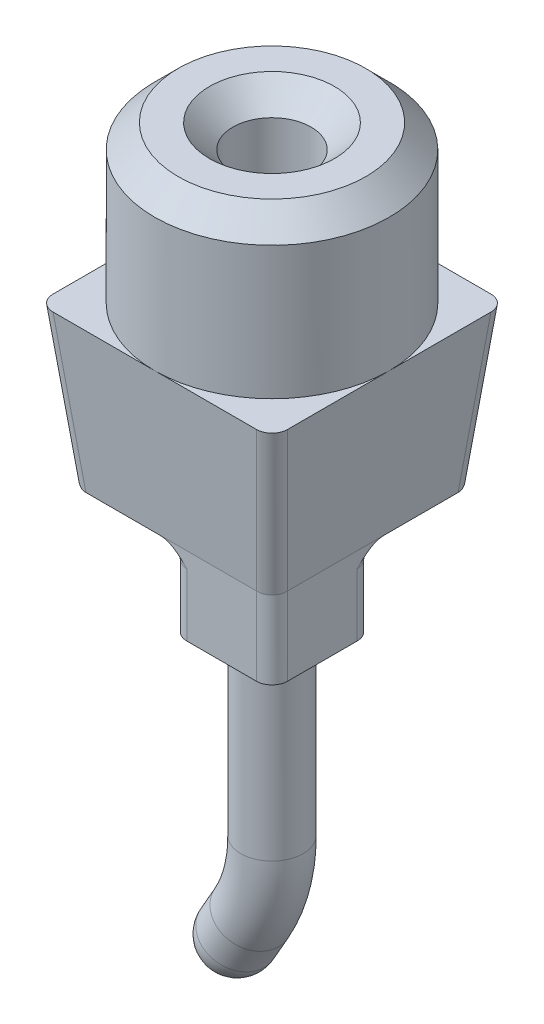
ISO-10303-21;
HEADER;
FILE_DESCRIPTION(('STEP AP214'),'2;1');
FILE_NAME('part.step','',(''),(''),'','','');
FILE_SCHEMA(('AUTOMOTIVE_DESIGN { 1 0 10303 214 1 1 1 1 }'));
ENDSEC;
DATA;
#1=APPLICATION_CONTEXT('core data for automotive mechanical design processes');
#2=APPLICATION_PROTOCOL_DEFINITION('international standard','automotive_design',2000,#1);
#3=PRODUCT_CONTEXT('',#1,'mechanical');
#4=PRODUCT('Part','Part','',(#3));
#5=PRODUCT_RELATED_PRODUCT_CATEGORY('part','',(#4));
#6=PRODUCT_DEFINITION_FORMATION('','',#4);
#7=PRODUCT_DEFINITION_CONTEXT('part definition',#1,'design');
#8=PRODUCT_DEFINITION('design','',#6,#7);
#9=PRODUCT_DEFINITION_SHAPE('','',#8);
#10=(LENGTH_UNIT() NAMED_UNIT(*) SI_UNIT(.MILLI.,.METRE.));
#11=(NAMED_UNIT(*) PLANE_ANGLE_UNIT() SI_UNIT($,.RADIAN.));
#12=(NAMED_UNIT(*) SI_UNIT($,.STERADIAN.) SOLID_ANGLE_UNIT());
#13=UNCERTAINTY_MEASURE_WITH_UNIT(LENGTH_MEASURE(1.E-05),#10,'distance_accuracy_value','');
#14=(GEOMETRIC_REPRESENTATION_CONTEXT(3) GLOBAL_UNCERTAINTY_ASSIGNED_CONTEXT((#13)) GLOBAL_UNIT_ASSIGNED_CONTEXT((#10,
#11,#12)) REPRESENTATION_CONTEXT('',''));
#15=CARTESIAN_POINT('',(0.,0.,0.));
#16=DIRECTION('',(0.,0.,1.));
#17=DIRECTION('',(1.,0.,0.));
#18=AXIS2_PLACEMENT_3D('',#15,#16,#17);
#19=CARTESIAN_POINT('',(0.,-40.,0.));
#20=DIRECTION('',(0.,-1.,0.));
#21=DIRECTION('',(0.,0.,-1.));
#22=AXIS2_PLACEMENT_3D('',#19,#20,#21);
#23=PLANE('',#22);
#24=DIRECTION('',(0.,0.,1.));
#25=VECTOR('',#24,1.);
#26=CARTESIAN_POINT('',(-11.0971072060908,-40.,0.));
#27=LINE('',#26,#25);
#28=CARTESIAN_POINT('',(-11.0971072060908,-40.,12.8890761298714));
#29=VERTEX_POINT('',#28);
#30=CARTESIAN_POINT('',(-11.0971072060908,-40.,-11.0971072060908));
#31=VERTEX_POINT('',#30);
#32=EDGE_CURVE('E186',#29,#31,#27,.F.);
#33=ORIENTED_EDGE('',*,*,#32,.T.);
#34=DIRECTION('',(-1.,0.,0.));
#35=VECTOR('',#34,1.);
#36=CARTESIAN_POINT('',(10.9088715039499,-40.,-11.0971072060908));
#37=LINE('',#36,#35);
#38=CARTESIAN_POINT('',(12.8890761298714,-40.,-11.0971072060908));
#39=VERTEX_POINT('',#38);
#40=EDGE_CURVE('E194',#31,#39,#37,.F.);
#41=ORIENTED_EDGE('',*,*,#40,.T.);
#42=CARTESIAN_POINT('',(10.8868987355594,-40.,-10.8868987355594));
#43=DIRECTION('',(0.,-1.,0.));
#44=DIRECTION('',(0.707106781186548,0.,-0.707106781186548));
#45=AXIS2_PLACEMENT_3D('',#42,#43,#44);
#46=ELLIPSE('',#45,2.0219730963013,2.);
#47=CARTESIAN_POINT('',(12.8979152946865,-40.,-10.9088715039499));
#48=VERTEX_POINT('',#47);
#49=EDGE_CURVE('E453',#39,#48,#46,.T.);
#50=ORIENTED_EDGE('',*,*,#49,.T.);
#51=DIRECTION('',(0.,0.,-1.));
#52=VECTOR('',#51,1.);
#53=CARTESIAN_POINT('',(12.8979152946865,-40.,0.));
#54=LINE('',#53,#52);
#55=CARTESIAN_POINT('',(12.8979152946865,-40.,-1.46410161513775));
#56=VERTEX_POINT('',#55);
#57=EDGE_CURVE('E528',#48,#56,#54,.F.);
#58=ORIENTED_EDGE('',*,*,#57,.T.);
#59=CARTESIAN_POINT('',(10.8979152946865,-40.,2.));
#60=DIRECTION('',(0.,-1.,0.));
#61=DIRECTION('',(0.,0.,-1.));
#62=AXIS2_PLACEMENT_3D('',#59,#60,#61);
#63=CIRCLE('',#62,4.);
#64=CARTESIAN_POINT('',(10.8979152946865,-40.,-2.));
#65=VERTEX_POINT('',#64);
#66=EDGE_CURVE('E176',#56,#65,#63,.F.);
#67=ORIENTED_EDGE('',*,*,#66,.T.);
#68=DIRECTION('',(1.,0.,0.));
#69=VECTOR('',#68,1.);
#70=CARTESIAN_POINT('',(0.,-40.,-2.));
#71=LINE('',#70,#69);
#72=CARTESIAN_POINT('',(2.,-40.,-2.));
#73=VERTEX_POINT('',#72);
#74=EDGE_CURVE('E181',#65,#73,#71,.F.);
#75=ORIENTED_EDGE('',*,*,#74,.T.);
#76=CARTESIAN_POINT('',(2.,-40.,2.));
#77=DIRECTION('',(0.,-1.,0.));
#78=DIRECTION('',(0.,0.,-1.));
#79=AXIS2_PLACEMENT_3D('',#76,#77,#78);
#80=CIRCLE('',#79,4.);
#81=CARTESIAN_POINT('',(-2.,-40.,2.));
#82=VERTEX_POINT('',#81);
#83=EDGE_CURVE('E188',#73,#82,#80,.F.);
#84=ORIENTED_EDGE('',*,*,#83,.T.);
#85=DIRECTION('',(0.,0.,1.));
#86=VECTOR('',#85,1.);
#87=CARTESIAN_POINT('',(-2.,-40.,10.8979152946865));
#88=LINE('',#87,#86);
#89=CARTESIAN_POINT('',(-2.,-40.,10.8979152946865));
#90=VERTEX_POINT('',#89);
#91=EDGE_CURVE('E392',#82,#90,#88,.T.);
#92=ORIENTED_EDGE('',*,*,#91,.T.);
#93=CARTESIAN_POINT('',(2.,-40.,10.8979152946865));
#94=DIRECTION('',(0.,-1.,0.));
#95=DIRECTION('',(0.,0.,-1.));
#96=AXIS2_PLACEMENT_3D('',#93,#94,#95);
#97=CIRCLE('',#96,4.);
#98=CARTESIAN_POINT('',(-1.46410161513775,-40.,12.8979152946865));
#99=VERTEX_POINT('',#98);
#100=EDGE_CURVE('E180',#90,#99,#97,.F.);
#101=ORIENTED_EDGE('',*,*,#100,.T.);
#102=DIRECTION('',(1.,0.,0.));
#103=VECTOR('',#102,1.);
#104=CARTESIAN_POINT('',(0.,-40.,12.8979152946865));
#105=LINE('',#104,#103);
#106=CARTESIAN_POINT('',(-10.9088715039499,-40.,12.8979152946865));
#107=VERTEX_POINT('',#106);
#108=EDGE_CURVE('E531',#107,#99,#105,.T.);
#109=ORIENTED_EDGE('',*,*,#108,.F.);
#110=CARTESIAN_POINT('',(-10.8868987355594,-40.,10.8868987355594));
#111=DIRECTION('',(0.,-1.,0.));
#112=DIRECTION('',(-0.707106781186548,0.,0.707106781186548));
#113=AXIS2_PLACEMENT_3D('',#110,#111,#112);
#114=ELLIPSE('',#113,2.0219730963013,2.);
#115=EDGE_CURVE('E449',#107,#29,#114,.T.);
#116=ORIENTED_EDGE('',*,*,#115,.T.);
#117=EDGE_LOOP('',(#33,#41,#50,#58,#67,#75,#84,#92,#101,#109,#116));
#118=FACE_BOUND('',#117,.T.);
#119=ADVANCED_FACE('F51',(#118),#23,.T.);
#120=CARTESIAN_POINT('',(0.,-20.,0.));
#121=DIRECTION('',(0.,1.,0.));
#122=DIRECTION('',(0.,0.,1.));
#123=AXIS2_PLACEMENT_3D('',#120,#121,#122);
#124=CYLINDRICAL_SURFACE('',#123,5.);
#125=CARTESIAN_POINT('',(0.,-2.99999999999998,0.));
#126=DIRECTION('',(0.,1.,0.));
#127=DIRECTION('',(0.,0.,1.));
#128=AXIS2_PLACEMENT_3D('',#125,#126,#127);
#129=CIRCLE('',#128,5.);
#130=CARTESIAN_POINT('',(0.,-2.99999999999998,5.));
#131=VERTEX_POINT('',#130);
#132=EDGE_CURVE('E397',#131,#131,#129,.T.);
#133=ORIENTED_EDGE('',*,*,#132,.T.);
#134=EDGE_LOOP('',(#133));
#135=FACE_BOUND('',#134,.T.);
#136=CARTESIAN_POINT('',(0.,-20.,0.));
#137=DIRECTION('',(0.,1.,0.));
#138=DIRECTION('',(0.,0.,1.));
#139=AXIS2_PLACEMENT_3D('',#136,#137,#138);
#140=CIRCLE('',#139,5.);
#141=CARTESIAN_POINT('',(0.,-20.,5.));
#142=VERTEX_POINT('',#141);
#143=EDGE_CURVE('E524',#142,#142,#140,.T.);
#144=ORIENTED_EDGE('',*,*,#143,.F.);
#145=EDGE_LOOP('',(#144));
#146=FACE_BOUND('',#145,.T.);
#147=ADVANCED_FACE('F259',(#135,#146),#124,.F.);
#148=CARTESIAN_POINT('',(0.,-20.,0.));
#149=DIRECTION('',(0.,1.,0.));
#150=DIRECTION('',(0.,0.,1.));
#151=AXIS2_PLACEMENT_3D('',#148,#149,#150);
#152=CYLINDRICAL_SURFACE('',#151,15.);
#153=CARTESIAN_POINT('',(0.,-3.,0.));
#154=DIRECTION('',(0.,1.,0.));
#155=DIRECTION('',(0.,0.,1.));
#156=AXIS2_PLACEMENT_3D('',#153,#154,#155);
#157=CIRCLE('',#156,15.);
#158=CARTESIAN_POINT('',(0.,-3.,15.));
#159=VERTEX_POINT('',#158);
#160=EDGE_CURVE('E401',#159,#159,#157,.F.);
#161=ORIENTED_EDGE('',*,*,#160,.T.);
#162=EDGE_LOOP('',(#161));
#163=FACE_BOUND('',#162,.T.);
#164=CARTESIAN_POINT('',(0.,-20.,0.));
#165=DIRECTION('',(0.,1.,0.));
#166=DIRECTION('',(0.,0.,1.));
#167=AXIS2_PLACEMENT_3D('',#164,#165,#166);
#168=CIRCLE('',#167,15.);
#169=CARTESIAN_POINT('',(0.,-20.,15.));
#170=VERTEX_POINT('',#169);
#171=CARTESIAN_POINT('',(15.,-20.,0.));
#172=VERTEX_POINT('',#171);
#173=EDGE_CURVE('E518',#170,#172,#168,.T.);
#174=ORIENTED_EDGE('',*,*,#173,.T.);
#175=CARTESIAN_POINT('',(0.,-20.,-15.));
#176=VERTEX_POINT('',#175);
#177=EDGE_CURVE('E522',#172,#176,#168,.T.);
#178=ORIENTED_EDGE('',*,*,#177,.T.);
#179=CARTESIAN_POINT('',(-15.,-20.,0.));
#180=VERTEX_POINT('',#179);
#181=EDGE_CURVE('E674',#176,#180,#168,.T.);
#182=ORIENTED_EDGE('',*,*,#181,.T.);
#183=EDGE_CURVE('E523',#180,#170,#168,.T.);
#184=ORIENTED_EDGE('',*,*,#183,.T.);
#185=EDGE_LOOP('',(#174,#178,#182,#184));
#186=FACE_BOUND('',#185,.T.);
#187=ADVANCED_FACE('F264',(#163,#186),#152,.T.);
#188=CARTESIAN_POINT('',(0.,0.,0.));
#189=DIRECTION('',(0.,1.,0.));
#190=DIRECTION('',(0.,0.,1.));
#191=AXIS2_PLACEMENT_3D('',#188,#189,#190);
#192=PLANE('',#191);
#193=CARTESIAN_POINT('',(0.,0.,0.));
#194=DIRECTION('',(0.,1.,0.));
#195=DIRECTION('',(0.,0.,1.));
#196=AXIS2_PLACEMENT_3D('',#193,#194,#195);
#197=CIRCLE('',#196,12.);
#198=CARTESIAN_POINT('',(0.,0.,12.));
#199=VERTEX_POINT('',#198);
#200=EDGE_CURVE('E407',#199,#199,#197,.T.);
#201=ORIENTED_EDGE('',*,*,#200,.T.);
#202=EDGE_LOOP('',(#201));
#203=FACE_BOUND('',#202,.T.);
#204=CARTESIAN_POINT('',(0.,0.,0.));
#205=DIRECTION('',(0.,1.,0.));
#206=DIRECTION('',(0.,0.,1.));
#207=AXIS2_PLACEMENT_3D('',#204,#205,#206);
#208=CIRCLE('',#207,8.00000000000001);
#209=CARTESIAN_POINT('',(0.,0.,8.00000000000001));
#210=VERTEX_POINT('',#209);
#211=EDGE_CURVE('E411',#210,#210,#208,.F.);
#212=ORIENTED_EDGE('',*,*,#211,.T.);
#213=EDGE_LOOP('',(#212));
#214=FACE_BOUND('',#213,.T.);
#215=ADVANCED_FACE('F275',(#203,#214),#192,.T.);
#216=CARTESIAN_POINT('',(0.,-20.,0.));
#217=DIRECTION('',(0.,-1.,0.));
#218=DIRECTION('',(0.,0.,-1.));
#219=AXIS2_PLACEMENT_3D('',#216,#217,#218);
#220=PLANE('',#219);
#221=DIRECTION('',(0.,0.,1.));
#222=VECTOR('',#221,1.);
#223=CARTESIAN_POINT('',(-15.,-20.,0.));
#224=LINE('',#223,#222);
#225=CARTESIAN_POINT('',(-15.,-20.,13.0109562092635));
#226=VERTEX_POINT('',#225);
#227=EDGE_CURVE('E549',#180,#226,#224,.T.);
#228=ORIENTED_EDGE('',*,*,#227,.T.);
#229=CARTESIAN_POINT('',(-12.988983440873,-20.,12.988983440873));
#230=DIRECTION('',(0.,-1.,0.));
#231=DIRECTION('',(-0.707106781186548,0.,0.707106781186548));
#232=AXIS2_PLACEMENT_3D('',#229,#230,#231);
#233=ELLIPSE('',#232,2.0219730963013,2.);
#234=CARTESIAN_POINT('',(-13.0109562092635,-20.,15.));
#235=VERTEX_POINT('',#234);
#236=EDGE_CURVE('E445',#226,#235,#233,.F.);
#237=ORIENTED_EDGE('',*,*,#236,.T.);
#238=DIRECTION('',(1.,0.,0.));
#239=VECTOR('',#238,1.);
#240=CARTESIAN_POINT('',(0.,-20.,15.));
#241=LINE('',#240,#239);
#242=EDGE_CURVE('E550',#235,#170,#241,.T.);
#243=ORIENTED_EDGE('',*,*,#242,.T.);
#244=ORIENTED_EDGE('',*,*,#183,.F.);
#245=EDGE_LOOP('',(#228,#237,#243,#244));
#246=FACE_BOUND('',#245,.T.);
#247=ADVANCED_FACE('F271',(#246),#220,.F.);
#248=CARTESIAN_POINT('',(15.,-20.,0.));
#249=DIRECTION('',(0.994521895368273,-0.104528463267653,0.));
#250=DIRECTION('',(0.104528463267653,0.994521895368273,0.));
#251=AXIS2_PLACEMENT_3D('',#248,#249,#250);
#252=PLANE('',#251);
#253=ORIENTED_EDGE('',*,*,#57,.F.);
#254=DIRECTION('',(-0.103962051184498,-0.989132844377854,0.103962051184498));
#255=VECTOR('',#254,1.);
#256=CARTESIAN_POINT('',(14.8593761789817,-21.3379462841133,-12.8703323882452));
#257=LINE('',#256,#255);
#258=CARTESIAN_POINT('',(15.,-20.,-13.0109562092635));
#259=VERTEX_POINT('',#258);
#260=EDGE_CURVE('E430',#48,#259,#257,.F.);
#261=ORIENTED_EDGE('',*,*,#260,.T.);
#262=DIRECTION('',(0.,0.,1.));
#263=VECTOR('',#262,1.);
#264=CARTESIAN_POINT('',(15.,-20.,0.));
#265=LINE('',#264,#263);
#266=EDGE_CURVE('E535',#259,#172,#265,.T.);
#267=ORIENTED_EDGE('',*,*,#266,.T.);
#268=CARTESIAN_POINT('',(15.,-20.,13.0109562092635));
#269=VERTEX_POINT('',#268);
#270=EDGE_CURVE('E539',#172,#269,#265,.T.);
#271=ORIENTED_EDGE('',*,*,#270,.T.);
#272=DIRECTION('',(0.103962051184498,0.989132844377854,0.103962051184498));
#273=VECTOR('',#272,1.);
#274=CARTESIAN_POINT('',(12.9194130949655,-39.7954620931811,10.930369304229));
#275=LINE('',#274,#273);
#276=CARTESIAN_POINT('',(12.8978854481134,-40.0002839711743,10.9088416573768));
#277=VERTEX_POINT('',#276);
#278=EDGE_CURVE('E434',#269,#277,#275,.F.);
#279=ORIENTED_EDGE('',*,*,#278,.T.);
#280=CARTESIAN_POINT('',(10.8979152946865,-59.0287289084452,10.8979152946865));
#281=DIRECTION('',(0.994521895368273,-0.104528463267653,0.));
#282=DIRECTION('',(0.104528463267653,0.994521895368273,0.));
#283=AXIS2_PLACEMENT_3D('',#280,#281,#282);
#284=ELLIPSE('',#283,19.1335444670112,2.);
#285=CARTESIAN_POINT('',(12.8979152946865,-40.,10.8979152946865));
#286=VERTEX_POINT('',#285);
#287=EDGE_CURVE('E414',#277,#286,#284,.F.);
#288=ORIENTED_EDGE('',*,*,#287,.T.);
#289=DIRECTION('',(0.,0.,1.));
#290=VECTOR('',#289,1.);
#291=CARTESIAN_POINT('',(12.8979152946865,-40.,0.));
#292=LINE('',#291,#290);
#293=EDGE_CURVE('E70',#56,#286,#292,.T.);
#294=ORIENTED_EDGE('',*,*,#293,.F.);
#295=EDGE_LOOP('',(#253,#261,#267,#271,#279,#288,#294));
#296=FACE_BOUND('',#295,.T.);
#297=ADVANCED_FACE('F274',(#296),#252,.T.);
#298=CARTESIAN_POINT('',(0.,-20.,-15.));
#299=DIRECTION('',(0.,-0.104528463267653,-0.994521895368273));
#300=DIRECTION('',(0.,0.994521895368273,-0.104528463267653));
#301=AXIS2_PLACEMENT_3D('',#298,#299,#300);
#302=PLANE('',#301);
#303=DIRECTION('',(-0.103962051184498,-0.989132844377854,0.103962051184498));
#304=VECTOR('',#303,1.);
#305=CARTESIAN_POINT('',(12.8703323882452,-21.3379462841133,-14.8593761789817));
#306=LINE('',#305,#304);
#307=CARTESIAN_POINT('',(13.0109562092635,-20.,-15.));
#308=VERTEX_POINT('',#307);
#309=CARTESIAN_POINT('',(11.0971072060908,-38.2090569265353,-13.0861509968273));
#310=VERTEX_POINT('',#309);
#311=EDGE_CURVE('E173',#308,#310,#306,.T.);
#312=ORIENTED_EDGE('',*,*,#311,.T.);
#313=DIRECTION('',(1.,0.,0.));
#314=VECTOR('',#313,1.);
#315=CARTESIAN_POINT('',(-10.9088715039499,-38.2090569265353,-13.0861509968273));
#316=LINE('',#315,#314);
#317=CARTESIAN_POINT('',(-11.0971072060908,-38.2090569265353,-13.0861509968273));
#318=VERTEX_POINT('',#317);
#319=EDGE_CURVE('E199',#310,#318,#316,.F.);
#320=ORIENTED_EDGE('',*,*,#319,.T.);
#321=DIRECTION('',(-0.103962051184498,0.989132844377854,-0.103962051184498));
#322=VECTOR('',#321,1.);
#323=CARTESIAN_POINT('',(-13.0324540095425,-19.7954620931811,-15.0214978002791));
#324=LINE('',#323,#322);
#325=CARTESIAN_POINT('',(-13.0109562092635,-20.,-15.));
#326=VERTEX_POINT('',#325);
#327=EDGE_CURVE('E469',#318,#326,#324,.T.);
#328=ORIENTED_EDGE('',*,*,#327,.T.);
#329=DIRECTION('',(1.,0.,0.));
#330=VECTOR('',#329,1.);
#331=CARTESIAN_POINT('',(0.,-20.,-15.));
#332=LINE('',#331,#330);
#333=EDGE_CURVE('E540',#326,#176,#332,.T.);
#334=ORIENTED_EDGE('',*,*,#333,.T.);
#335=EDGE_CURVE('E544',#176,#308,#332,.T.);
#336=ORIENTED_EDGE('',*,*,#335,.T.);
#337=EDGE_LOOP('',(#312,#320,#328,#334,#336));
#338=FACE_BOUND('',#337,.T.);
#339=ADVANCED_FACE('F286',(#338),#302,.T.);
#340=CARTESIAN_POINT('',(-15.,-20.,0.));
#341=DIRECTION('',(-0.994521895368273,-0.104528463267653,0.));
#342=DIRECTION('',(0.104528463267653,-0.994521895368273,0.));
#343=AXIS2_PLACEMENT_3D('',#340,#341,#342);
#344=PLANE('',#343);
#345=DIRECTION('',(0.103962051184498,-0.989132844377854,0.103962051184498));
#346=VECTOR('',#345,1.);
#347=CARTESIAN_POINT('',(-12.9194130949655,-39.7954620931811,-10.930369304229));
#348=LINE('',#347,#346);
#349=CARTESIAN_POINT('',(-15.,-20.,-13.0109562092635));
#350=VERTEX_POINT('',#349);
#351=CARTESIAN_POINT('',(-13.0861509968273,-38.2090569265353,-11.0971072060908));
#352=VERTEX_POINT('',#351);
#353=EDGE_CURVE('E457',#350,#352,#348,.T.);
#354=ORIENTED_EDGE('',*,*,#353,.T.);
#355=DIRECTION('',(0.,0.,1.));
#356=VECTOR('',#355,1.);
#357=CARTESIAN_POINT('',(-13.0861509968273,-38.2090569265353,0.));
#358=LINE('',#357,#356);
#359=CARTESIAN_POINT('',(-13.0861509968273,-38.2090569265353,11.0971072060908));
#360=VERTEX_POINT('',#359);
#361=EDGE_CURVE('E205',#352,#360,#358,.T.);
#362=ORIENTED_EDGE('',*,*,#361,.T.);
#363=DIRECTION('',(-0.103962051184498,0.989132844377854,0.103962051184498));
#364=VECTOR('',#363,1.);
#365=CARTESIAN_POINT('',(-14.8593761789817,-21.3379462841133,12.8703323882452));
#366=LINE('',#365,#364);
#367=EDGE_CURVE('E461',#360,#226,#366,.T.);
#368=ORIENTED_EDGE('',*,*,#367,.T.);
#369=ORIENTED_EDGE('',*,*,#227,.F.);
#370=EDGE_CURVE('E545',#350,#180,#224,.T.);
#371=ORIENTED_EDGE('',*,*,#370,.F.);
#372=EDGE_LOOP('',(#354,#362,#368,#369,#371));
#373=FACE_BOUND('',#372,.T.);
#374=ADVANCED_FACE('F282',(#373),#344,.T.);
#375=CARTESIAN_POINT('',(0.,-20.,15.));
#376=DIRECTION('',(0.,-0.104528463267653,0.994521895368273));
#377=DIRECTION('',(0.,-0.994521895368273,-0.104528463267653));
#378=AXIS2_PLACEMENT_3D('',#375,#376,#377);
#379=PLANE('',#378);
#380=ORIENTED_EDGE('',*,*,#242,.F.);
#381=DIRECTION('',(-0.103962051184498,0.989132844377854,0.103962051184498));
#382=VECTOR('',#381,1.);
#383=CARTESIAN_POINT('',(-12.8703323882452,-21.3379462841133,14.8593761789817));
#384=LINE('',#383,#382);
#385=EDGE_CURVE('E437',#235,#107,#384,.F.);
#386=ORIENTED_EDGE('',*,*,#385,.T.);
#387=ORIENTED_EDGE('',*,*,#108,.T.);
#388=DIRECTION('',(-1.,0.,0.));
#389=VECTOR('',#388,1.);
#390=CARTESIAN_POINT('',(0.,-40.,12.8979152946865));
#391=LINE('',#390,#389);
#392=CARTESIAN_POINT('',(10.8979152946865,-40.,12.8979152946865));
#393=VERTEX_POINT('',#392);
#394=EDGE_CURVE('E93',#393,#99,#391,.T.);
#395=ORIENTED_EDGE('',*,*,#394,.F.);
#396=CARTESIAN_POINT('',(10.8979152946865,-59.0287289084452,10.8979152946865));
#397=DIRECTION('',(0.,-0.104528463267653,0.994521895368273));
#398=DIRECTION('',(0.,0.994521895368273,0.104528463267653));
#399=AXIS2_PLACEMENT_3D('',#396,#397,#398);
#400=ELLIPSE('',#399,19.1335444670112,2.);
#401=CARTESIAN_POINT('',(10.9088416573768,-40.0002839711743,12.8978854481134));
#402=VERTEX_POINT('',#401);
#403=EDGE_CURVE('E418',#393,#402,#400,.F.);
#404=ORIENTED_EDGE('',*,*,#403,.T.);
#405=DIRECTION('',(-0.103962051184498,-0.989132844377854,-0.103962051184498));
#406=VECTOR('',#405,1.);
#407=CARTESIAN_POINT('',(13.0324540095425,-19.7954620931811,15.0214978002791));
#408=LINE('',#407,#406);
#409=CARTESIAN_POINT('',(13.0109562092635,-20.,15.));
#410=VERTEX_POINT('',#409);
#411=EDGE_CURVE('E441',#402,#410,#408,.F.);
#412=ORIENTED_EDGE('',*,*,#411,.T.);
#413=EDGE_CURVE('E554',#170,#410,#241,.T.);
#414=ORIENTED_EDGE('',*,*,#413,.F.);
#415=EDGE_LOOP('',(#380,#386,#387,#395,#404,#412,#414));
#416=FACE_BOUND('',#415,.T.);
#417=ADVANCED_FACE('F279',(#416),#379,.T.);
#418=ORIENTED_EDGE('',*,*,#333,.F.);
#419=CARTESIAN_POINT('',(-12.988983440873,-20.,-12.988983440873));
#420=DIRECTION('',(0.,-1.,0.));
#421=DIRECTION('',(-0.707106781186548,0.,-0.707106781186548));
#422=AXIS2_PLACEMENT_3D('',#419,#420,#421);
#423=ELLIPSE('',#422,2.0219730963013,2.);
#424=EDGE_CURVE('E465',#326,#350,#423,.F.);
#425=ORIENTED_EDGE('',*,*,#424,.T.);
#426=ORIENTED_EDGE('',*,*,#370,.T.);
#427=ORIENTED_EDGE('',*,*,#181,.F.);
#428=EDGE_LOOP('',(#418,#425,#426,#427));
#429=FACE_BOUND('',#428,.T.);
#430=ADVANCED_FACE('F278',(#429),#220,.F.);
#431=ORIENTED_EDGE('',*,*,#266,.F.);
#432=CARTESIAN_POINT('',(12.988983440873,-20.,-12.988983440873));
#433=DIRECTION('',(0.,-1.,0.));
#434=DIRECTION('',(0.707106781186548,0.,-0.707106781186548));
#435=AXIS2_PLACEMENT_3D('',#432,#433,#434);
#436=ELLIPSE('',#435,2.0219730963013,2.);
#437=EDGE_CURVE('E426',#259,#308,#436,.F.);
#438=ORIENTED_EDGE('',*,*,#437,.T.);
#439=ORIENTED_EDGE('',*,*,#335,.F.);
#440=ORIENTED_EDGE('',*,*,#177,.F.);
#441=EDGE_LOOP('',(#431,#438,#439,#440));
#442=FACE_BOUND('',#441,.T.);
#443=ADVANCED_FACE('F665',(#442),#220,.F.);
#444=ORIENTED_EDGE('',*,*,#413,.T.);
#445=CARTESIAN_POINT('',(12.988983440873,-20.,12.988983440873));
#446=DIRECTION('',(0.,-1.,0.));
#447=DIRECTION('',(0.707106781186548,0.,0.707106781186548));
#448=AXIS2_PLACEMENT_3D('',#445,#446,#447);
#449=ELLIPSE('',#448,2.0219730963013,2.);
#450=EDGE_CURVE('E422',#410,#269,#449,.F.);
#451=ORIENTED_EDGE('',*,*,#450,.T.);
#452=ORIENTED_EDGE('',*,*,#270,.F.);
#453=ORIENTED_EDGE('',*,*,#173,.F.);
#454=EDGE_LOOP('',(#444,#451,#452,#453));
#455=FACE_BOUND('',#454,.T.);
#456=ADVANCED_FACE('F677',(#455),#220,.F.);
#457=ORIENTED_EDGE('',*,*,#143,.T.);
#458=EDGE_LOOP('',(#457));
#459=FACE_BOUND('',#458,.T.);
#460=ADVANCED_FACE('F277',(#459),#220,.F.);
#461=CARTESIAN_POINT('',(0.,-50.,0.));
#462=DIRECTION('',(-1.,0.,0.));
#463=DIRECTION('',(0.,0.,1.));
#464=AXIS2_PLACEMENT_3D('',#461,#462,#463);
#465=PLANE('',#464);
#466=DIRECTION('',(0.,1.,0.));
#467=VECTOR('',#466,1.);
#468=CARTESIAN_POINT('',(0.,-40.,10.8979152946865));
#469=LINE('',#468,#467);
#470=CARTESIAN_POINT('',(0.,-50.,10.8979152946865));
#471=VERTEX_POINT('',#470);
#472=CARTESIAN_POINT('',(0.,-42.,10.8979152946865));
#473=VERTEX_POINT('',#472);
#474=EDGE_CURVE('E507',#471,#473,#469,.T.);
#475=ORIENTED_EDGE('',*,*,#474,.T.);
#476=DIRECTION('',(0.,0.,1.));
#477=VECTOR('',#476,1.);
#478=CARTESIAN_POINT('',(0.,-42.,2.));
#479=LINE('',#478,#477);
#480=CARTESIAN_POINT('',(0.,-42.,2.));
#481=VERTEX_POINT('',#480);
#482=EDGE_CURVE('E79',#473,#481,#479,.F.);
#483=ORIENTED_EDGE('',*,*,#482,.T.);
#484=DIRECTION('',(0.,1.,0.));
#485=VECTOR('',#484,1.);
#486=CARTESIAN_POINT('',(0.,-50.,2.));
#487=LINE('',#486,#485);
#488=CARTESIAN_POINT('',(0.,-50.,2.));
#489=VERTEX_POINT('',#488);
#490=EDGE_CURVE('E510',#481,#489,#487,.F.);
#491=ORIENTED_EDGE('',*,*,#490,.T.);
#492=DIRECTION('',(0.,0.,1.));
#493=VECTOR('',#492,1.);
#494=CARTESIAN_POINT('',(0.,-50.,0.));
#495=LINE('',#494,#493);
#496=EDGE_CURVE('E557',#489,#471,#495,.T.);
#497=ORIENTED_EDGE('',*,*,#496,.T.);
#498=EDGE_LOOP('',(#475,#483,#491,#497));
#499=FACE_BOUND('',#498,.T.);
#500=ADVANCED_FACE('F269',(#499),#465,.T.);
#501=CARTESIAN_POINT('',(0.,-50.,0.));
#502=DIRECTION('',(0.,0.,1.));
#503=DIRECTION('',(1.,0.,0.));
#504=AXIS2_PLACEMENT_3D('',#501,#502,#503);
#505=PLANE('',#504);
#506=DIRECTION('',(0.,1.,0.));
#507=VECTOR('',#506,1.);
#508=CARTESIAN_POINT('',(2.,-40.,0.));
#509=LINE('',#508,#507);
#510=CARTESIAN_POINT('',(2.,-50.,0.));
#511=VERTEX_POINT('',#510);
#512=CARTESIAN_POINT('',(2.,-42.,0.));
#513=VERTEX_POINT('',#512);
#514=EDGE_CURVE('E478',#511,#513,#509,.T.);
#515=ORIENTED_EDGE('',*,*,#514,.T.);
#516=DIRECTION('',(1.,0.,0.));
#517=VECTOR('',#516,1.);
#518=CARTESIAN_POINT('',(0.,-42.,0.));
#519=LINE('',#518,#517);
#520=CARTESIAN_POINT('',(10.8979152946865,-42.,0.));
#521=VERTEX_POINT('',#520);
#522=EDGE_CURVE('E162',#513,#521,#519,.T.);
#523=ORIENTED_EDGE('',*,*,#522,.T.);
#524=DIRECTION('',(0.,1.,0.));
#525=VECTOR('',#524,1.);
#526=CARTESIAN_POINT('',(10.8979152946865,-50.,0.));
#527=LINE('',#526,#525);
#528=CARTESIAN_POINT('',(10.8979152946865,-50.,0.));
#529=VERTEX_POINT('',#528);
#530=EDGE_CURVE('E156',#521,#529,#527,.F.);
#531=ORIENTED_EDGE('',*,*,#530,.T.);
#532=DIRECTION('',(1.,0.,0.));
#533=VECTOR('',#532,1.);
#534=CARTESIAN_POINT('',(0.,-50.,0.));
#535=LINE('',#534,#533);
#536=EDGE_CURVE('E567',#511,#529,#535,.T.);
#537=ORIENTED_EDGE('',*,*,#536,.F.);
#538=EDGE_LOOP('',(#515,#523,#531,#537));
#539=FACE_BOUND('',#538,.T.);
#540=ADVANCED_FACE('F700',(#539),#505,.F.);
#541=CARTESIAN_POINT('',(12.8979152946865,-50.,0.));
#542=DIRECTION('',(-1.,0.,0.));
#543=DIRECTION('',(0.,0.,1.));
#544=AXIS2_PLACEMENT_3D('',#541,#542,#543);
#545=PLANE('',#544);
#546=DIRECTION('',(0.,0.,1.));
#547=VECTOR('',#546,1.);
#548=CARTESIAN_POINT('',(12.8979152946865,-50.,0.));
#549=LINE('',#548,#547);
#550=CARTESIAN_POINT('',(12.8979152946865,-50.,2.));
#551=VERTEX_POINT('',#550);
#552=CARTESIAN_POINT('',(12.8979152946865,-50.,10.8979152946865));
#553=VERTEX_POINT('',#552);
#554=EDGE_CURVE('E171',#551,#553,#549,.T.);
#555=ORIENTED_EDGE('',*,*,#554,.F.);
#556=DIRECTION('',(0.,1.,0.));
#557=VECTOR('',#556,1.);
#558=CARTESIAN_POINT('',(12.8979152946865,-50.,2.));
#559=LINE('',#558,#557);
#560=CARTESIAN_POINT('',(12.8979152946865,-42.,2.));
#561=VERTEX_POINT('',#560);
#562=EDGE_CURVE('E154',#551,#561,#559,.T.);
#563=ORIENTED_EDGE('',*,*,#562,.T.);
#564=CARTESIAN_POINT('',(12.8979152946865,-40.,-1.46410161513775));
#565=CARTESIAN_POINT('',(12.8979152946865,-39.9999881505854,-1.37840629812429));
#566=CARTESIAN_POINT('',(12.8979152946865,-40.004128939751,-1.29276105949725));
#567=CARTESIAN_POINT('',(12.8979152946865,-40.0201470604538,-1.12232102480843));
#568=CARTESIAN_POINT('',(12.8979152946865,-40.0320126185145,-1.03752513361634));
#569=CARTESIAN_POINT('',(12.8979152946865,-40.0627287730668,-0.870283145306773));
#570=CARTESIAN_POINT('',(12.8979152946865,-40.0814935023679,-0.787821046818152));
#571=CARTESIAN_POINT('',(12.8979152946865,-40.125438829068,-0.624598952164177));
#572=CARTESIAN_POINT('',(12.8979152946865,-40.1506224912804,-0.543839789089646));
#573=CARTESIAN_POINT('',(12.8979152946865,-40.2172470542596,-0.354732495086528));
#574=CARTESIAN_POINT('',(12.8979152946865,-40.2612516121676,-0.247284156602701));
#575=CARTESIAN_POINT('',(12.8979152946865,-40.3586457173186,-0.0366927672734265));
#576=CARTESIAN_POINT('',(12.8979152946865,-40.4120427707877,0.0664467578854988));
#577=CARTESIAN_POINT('',(12.8979152946865,-40.5845375476103,0.370001332193612));
#578=CARTESIAN_POINT('',(12.8979152946865,-40.7155906576635,0.56363137932445));
#579=CARTESIAN_POINT('',(12.8979152946865,-41.0272402304036,0.973116305858894));
#580=CARTESIAN_POINT('',(12.8979152946865,-41.2124774804823,1.18528484878477));
#581=CARTESIAN_POINT('',(12.8979152946865,-41.5963584532387,1.59621663180487));
#582=CARTESIAN_POINT('',(12.8979152946865,-41.7949916479039,1.79499015910665));
#583=CARTESIAN_POINT('',(12.8979152946865,-41.9957836320311,1.99578363185557));
#584=CARTESIAN_POINT('',(12.8979152946865,-41.9978918171785,1.99789181699863));
#585=CARTESIAN_POINT('',(12.8979152946865,-42.,2.));
#586=B_SPLINE_CURVE_WITH_KNOTS('',3,(#564,#565,#566,#567,#568,#569,#570,#571,#572,#573,#574,
#575,#576,#577,#578,#579,#580,#581,#582,#583,#584,#585),.UNSPECIFIED.,.F.,.F.,(4,2,2,2,2,2,2,2,
2,2,4),(0.,0.256912595777846,0.513434539685122,0.766866291390349,1.02041927520561,
1.36819331305816,1.71624655574917,2.41527069662684,3.25887239086172,4.10181864660848,
4.11076291851909),.UNSPECIFIED.);
#587=EDGE_CURVE('E11',#561,#56,#586,.F.);
#588=ORIENTED_EDGE('',*,*,#587,.T.);
#589=ORIENTED_EDGE('',*,*,#293,.T.);
#590=DIRECTION('',(0.,1.,0.));
#591=VECTOR('',#590,1.);
#592=CARTESIAN_POINT('',(12.8979152946865,-50.,10.8979152946865));
#593=LINE('',#592,#591);
#594=EDGE_CURVE('E174',#286,#553,#593,.F.);
#595=ORIENTED_EDGE('',*,*,#594,.T.);
#596=EDGE_LOOP('',(#555,#563,#588,#589,#595));
#597=FACE_BOUND('',#596,.T.);
#598=ADVANCED_FACE('F167',(#597),#545,.F.);
#599=CARTESIAN_POINT('',(0.,-50.,12.8979152946865));
#600=DIRECTION('',(0.,0.,-1.));
#601=DIRECTION('',(-1.,0.,0.));
#602=AXIS2_PLACEMENT_3D('',#599,#600,#601);
#603=PLANE('',#602);
#604=ORIENTED_EDGE('',*,*,#394,.T.);
#605=CARTESIAN_POINT('',(-1.46410161513775,-40.,12.8979152946865));
#606=CARTESIAN_POINT('',(-1.37840629812429,-39.9999881505854,12.8979152946865));
#607=CARTESIAN_POINT('',(-1.29276105949725,-40.004128939751,12.8979152946865));
#608=CARTESIAN_POINT('',(-1.12232102480843,-40.0201470604538,12.8979152946865));
#609=CARTESIAN_POINT('',(-1.03752513361634,-40.0320126185145,12.8979152946865));
#610=CARTESIAN_POINT('',(-0.870283145306773,-40.0627287730668,12.8979152946865));
#611=CARTESIAN_POINT('',(-0.787821046818152,-40.0814935023679,12.8979152946865));
#612=CARTESIAN_POINT('',(-0.624598952164177,-40.125438829068,12.8979152946865));
#613=CARTESIAN_POINT('',(-0.543839789089646,-40.1506224912804,12.8979152946865));
#614=CARTESIAN_POINT('',(-0.354732495086528,-40.2172470542596,12.8979152946865));
#615=CARTESIAN_POINT('',(-0.247284156602701,-40.2612516121676,12.8979152946865));
#616=CARTESIAN_POINT('',(-0.0366927672734265,-40.3586457173186,12.8979152946865));
#617=CARTESIAN_POINT('',(0.0664467578854988,-40.4120427707877,12.8979152946865));
#618=CARTESIAN_POINT('',(0.370001332193612,-40.5845375476103,12.8979152946865));
#619=CARTESIAN_POINT('',(0.56363137932445,-40.7155906576635,12.8979152946865));
#620=CARTESIAN_POINT('',(0.973116305858894,-41.0272402304036,12.8979152946865));
#621=CARTESIAN_POINT('',(1.18528484878477,-41.2124774804823,12.8979152946865));
#622=CARTESIAN_POINT('',(1.59621663180487,-41.5963584532387,12.8979152946865));
#623=CARTESIAN_POINT('',(1.79499015910665,-41.7949916479039,12.8979152946865));
#624=CARTESIAN_POINT('',(1.99578363185557,-41.9957836320311,12.8979152946865));
#625=CARTESIAN_POINT('',(1.99789181699863,-41.9978918171785,12.8979152946865));
#626=CARTESIAN_POINT('',(2.,-42.,12.8979152946865));
#627=B_SPLINE_CURVE_WITH_KNOTS('',3,(#605,#606,#607,#608,#609,#610,#611,#612,#613,#614,#615,
#616,#617,#618,#619,#620,#621,#622,#623,#624,#625,#626),.UNSPECIFIED.,.F.,.F.,(4,2,2,2,2,2,2,2,
2,2,4),(0.,0.256912595777846,0.513434539685122,0.766866291390349,1.02041927520561,
1.36819331305816,1.71624655574917,2.41527069662684,3.25887239086172,4.10181864660848,
4.11076291851909),.UNSPECIFIED.);
#628=CARTESIAN_POINT('',(2.,-42.,12.8979152946865));
#629=VERTEX_POINT('',#628);
#630=EDGE_CURVE('E62',#99,#629,#627,.T.);
#631=ORIENTED_EDGE('',*,*,#630,.T.);
#632=DIRECTION('',(0.,1.,0.));
#633=VECTOR('',#632,1.);
#634=CARTESIAN_POINT('',(2.,-50.,12.8979152946865));
#635=LINE('',#634,#633);
#636=CARTESIAN_POINT('',(2.,-50.,12.8979152946865));
#637=VERTEX_POINT('',#636);
#638=EDGE_CURVE('E500',#629,#637,#635,.F.);
#639=ORIENTED_EDGE('',*,*,#638,.T.);
#640=DIRECTION('',(-1.,0.,0.));
#641=VECTOR('',#640,1.);
#642=CARTESIAN_POINT('',(0.,-50.,12.8979152946865));
#643=LINE('',#642,#641);
#644=CARTESIAN_POINT('',(10.8979152946865,-50.,12.8979152946865));
#645=VERTEX_POINT('',#644);
#646=EDGE_CURVE('E561',#645,#637,#643,.T.);
#647=ORIENTED_EDGE('',*,*,#646,.F.);
#648=DIRECTION('',(0.,1.,0.));
#649=VECTOR('',#648,1.);
#650=CARTESIAN_POINT('',(10.8979152946865,-50.,12.8979152946865));
#651=LINE('',#650,#649);
#652=EDGE_CURVE('E504',#645,#393,#651,.T.);
#653=ORIENTED_EDGE('',*,*,#652,.T.);
#654=EDGE_LOOP('',(#604,#631,#639,#647,#653));
#655=FACE_BOUND('',#654,.T.);
#656=ADVANCED_FACE('F233',(#655),#603,.F.);
#657=CARTESIAN_POINT('',(0.,-50.,0.));
#658=DIRECTION('',(0.,-1.,0.));
#659=DIRECTION('',(0.,0.,-1.));
#660=AXIS2_PLACEMENT_3D('',#657,#658,#659);
#661=PLANE('',#660);
#662=CARTESIAN_POINT('',(6.44895764734324,-50.,6.44895764734324));
#663=DIRECTION('',(0.,-1.,0.));
#664=DIRECTION('',(0.,0.,-1.));
#665=AXIS2_PLACEMENT_3D('',#662,#663,#664);
#666=CIRCLE('',#665,4.);
#667=CARTESIAN_POINT('',(6.44895764734324,-50.,2.44895764734324));
#668=VERTEX_POINT('',#667);
#669=EDGE_CURVE('E517',#668,#668,#666,.T.);
#670=ORIENTED_EDGE('',*,*,#669,.F.);
#671=EDGE_LOOP('',(#670));
#672=FACE_BOUND('',#671,.T.);
#673=ORIENTED_EDGE('',*,*,#646,.T.);
#674=CARTESIAN_POINT('',(2.,-50.,10.8979152946865));
#675=DIRECTION('',(0.,-1.,0.));
#676=DIRECTION('',(0.,0.,-1.));
#677=AXIS2_PLACEMENT_3D('',#674,#675,#676);
#678=CIRCLE('',#677,2.);
#679=EDGE_CURVE('E484',#637,#471,#678,.T.);
#680=ORIENTED_EDGE('',*,*,#679,.T.);
#681=ORIENTED_EDGE('',*,*,#496,.F.);
#682=CARTESIAN_POINT('',(2.,-50.,2.));
#683=DIRECTION('',(0.,-1.,0.));
#684=DIRECTION('',(0.,0.,-1.));
#685=AXIS2_PLACEMENT_3D('',#682,#683,#684);
#686=CIRCLE('',#685,2.);
#687=EDGE_CURVE('E488',#489,#511,#686,.T.);
#688=ORIENTED_EDGE('',*,*,#687,.T.);
#689=ORIENTED_EDGE('',*,*,#536,.T.);
#690=CARTESIAN_POINT('',(10.8979152946865,-50.,2.));
#691=DIRECTION('',(0.,-1.,0.));
#692=DIRECTION('',(0.,0.,-1.));
#693=AXIS2_PLACEMENT_3D('',#690,#691,#692);
#694=CIRCLE('',#693,2.);
#695=EDGE_CURVE('E492',#529,#551,#694,.T.);
#696=ORIENTED_EDGE('',*,*,#695,.T.);
#697=ORIENTED_EDGE('',*,*,#554,.T.);
#698=CARTESIAN_POINT('',(10.8979152946865,-50.,10.8979152946865));
#699=DIRECTION('',(0.,-1.,0.));
#700=DIRECTION('',(0.,0.,-1.));
#701=AXIS2_PLACEMENT_3D('',#698,#699,#700);
#702=CIRCLE('',#701,2.);
#703=EDGE_CURVE('E496',#553,#645,#702,.T.);
#704=ORIENTED_EDGE('',*,*,#703,.T.);
#705=EDGE_LOOP('',(#673,#680,#681,#688,#689,#696,#697,#704));
#706=FACE_BOUND('',#705,.T.);
#707=ADVANCED_FACE('F585',(#672,#706),#661,.T.);
#708=CARTESIAN_POINT('',(6.44895764734324,-50.,6.44895764734324));
#709=DIRECTION('',(0.,-1.,0.));
#710=DIRECTION('',(0.,0.,-1.));
#711=AXIS2_PLACEMENT_3D('',#708,#709,#710);
#712=CYLINDRICAL_SURFACE('',#711,4.);
#713=CARTESIAN_POINT('',(6.44895764734324,-72.5519082985768,6.44895764734324));
#714=DIRECTION('',(0.,-1.,0.));
#715=DIRECTION('',(0.,0.,-1.));
#716=AXIS2_PLACEMENT_3D('',#713,#714,#715);
#717=CIRCLE('',#716,4.);
#718=CARTESIAN_POINT('',(10.4489576473431,-72.5519082985767,6.44895764734324));
#719=VERTEX_POINT('',#718);
#720=EDGE_CURVE('E372',#719,#719,#717,.T.);
#721=ORIENTED_EDGE('',*,*,#720,.F.);
#722=EDGE_LOOP('',(#721));
#723=FACE_BOUND('',#722,.T.);
#724=ORIENTED_EDGE('',*,*,#669,.T.);
#725=EDGE_LOOP('',(#724));
#726=FACE_BOUND('',#725,.T.);
#727=ADVANCED_FACE('F305',(#723,#726),#712,.T.);
#728=CARTESIAN_POINT('',(-13.5510423526568,-72.5519082985768,6.44895764734324));
#729=DIRECTION('',(0.,0.,-1.));
#730=DIRECTION('',(-1.,0.,0.));
#731=AXIS2_PLACEMENT_3D('',#728,#729,#730);
#732=TOROIDAL_SURFACE('',#731,19.9999999999998,4.);
#733=CARTESIAN_POINT('',(3.80971302360709,-82.4818716804592,6.44895764734324));
#734=DIRECTION('',(-0.496498169094121,-0.868037768813193,0.));
#735=DIRECTION('',(0.,0.,-1.));
#736=AXIS2_PLACEMENT_3D('',#733,#734,#735);
#737=CIRCLE('',#736,4.);
#738=CARTESIAN_POINT('',(7.28186409885971,-84.4678643568357,6.44895764734324));
#739=VERTEX_POINT('',#738);
#740=EDGE_CURVE('E560',#739,#739,#737,.T.);
#741=CARTESIAN_POINT('',(-13.5510423526568,-72.5519082985768,6.44895764734324));
#742=DIRECTION('',(0.,0.,-1.));
#743=DIRECTION('',(-1.,0.,0.));
#744=AXIS2_PLACEMENT_3D('',#741,#742,#743);
#745=CIRCLE('',#744,23.9999999999998);
#746=EDGE_CURVE('',#719,#739,#745,.T.);
#747=ORIENTED_EDGE('',*,*,#720,.T.);
#748=ORIENTED_EDGE('',*,*,#740,.F.);
#749=ORIENTED_EDGE('',*,*,#746,.T.);
#750=ORIENTED_EDGE('',*,*,#746,.F.);
#751=EDGE_LOOP('',(#747,#749,#748,#750));
#752=FACE_BOUND('',#751,.T.);
#753=ADVANCED_FACE('F856',(#752),#732,.T.);
#754=CARTESIAN_POINT('',(3.80971302360709,-82.4818716804592,6.44895764734324));
#755=DIRECTION('',(-0.496498169094118,-0.868037768813194,0.));
#756=DIRECTION('',(0.868037768813194,-0.496498169094118,0.));
#757=AXIS2_PLACEMENT_3D('',#754,#755,#756);
#758=CYLINDRICAL_SURFACE('',#757,4.);
#759=CARTESIAN_POINT('',(1.98599267637648,-85.6703187678627,6.44895764734324));
#760=DIRECTION('',(-0.496498169094118,-0.868037768813194,0.));
#761=DIRECTION('',(0.868037768813194,-0.496498169094118,0.));
#762=AXIS2_PLACEMENT_3D('',#759,#760,#761);
#763=CIRCLE('',#762,4.);
#764=CARTESIAN_POINT('',(5.45814375162926,-87.6563114442392,6.44895764734324));
#765=VERTEX_POINT('',#764);
#766=EDGE_CURVE('E513',#765,#765,#763,.F.);
#767=ORIENTED_EDGE('',*,*,#766,.T.);
#768=EDGE_LOOP('',(#767));
#769=FACE_BOUND('',#768,.T.);
#770=ORIENTED_EDGE('',*,*,#740,.T.);
#771=EDGE_LOOP('',(#770));
#772=FACE_BOUND('',#771,.T.);
#773=ADVANCED_FACE('F303',(#769,#772),#758,.T.);
#774=CARTESIAN_POINT('',(1.98599267637648,-85.6703187678627,6.44895764734324));
#775=DIRECTION('',(-0.496498169094118,-0.868037768813194,0.));
#776=DIRECTION('',(0.868037768813194,-0.496498169094118,0.));
#777=AXIS2_PLACEMENT_3D('',#774,#775,#776);
#778=SPHERICAL_SURFACE('',#777,4.);
#779=ORIENTED_EDGE('',*,*,#766,.F.);
#780=EDGE_LOOP('',(#779));
#781=FACE_BOUND('',#780,.T.);
#782=ADVANCED_FACE('F299',(#781),#778,.T.);
#783=CARTESIAN_POINT('',(2.,-50.,10.8979152946865));
#784=DIRECTION('',(0.,-1.,0.));
#785=DIRECTION('',(0.,0.,-1.));
#786=AXIS2_PLACEMENT_3D('',#783,#784,#785);
#787=CYLINDRICAL_SURFACE('',#786,2.);
#788=ORIENTED_EDGE('',*,*,#638,.F.);
#789=CARTESIAN_POINT('',(2.,-42.,10.8979152946865));
#790=DIRECTION('',(0.,-1.,0.));
#791=DIRECTION('',(0.,0.,-1.));
#792=AXIS2_PLACEMENT_3D('',#789,#790,#791);
#793=CIRCLE('',#792,2.);
#794=EDGE_CURVE('E163',#629,#473,#793,.T.);
#795=ORIENTED_EDGE('',*,*,#794,.T.);
#796=ORIENTED_EDGE('',*,*,#474,.F.);
#797=ORIENTED_EDGE('',*,*,#679,.F.);
#798=EDGE_LOOP('',(#788,#795,#796,#797));
#799=FACE_BOUND('',#798,.T.);
#800=ADVANCED_FACE('F302',(#799),#787,.T.);
#801=CARTESIAN_POINT('',(2.,-50.,2.));
#802=DIRECTION('',(0.,-1.,0.));
#803=DIRECTION('',(0.,0.,-1.));
#804=AXIS2_PLACEMENT_3D('',#801,#802,#803);
#805=CYLINDRICAL_SURFACE('',#804,2.);
#806=ORIENTED_EDGE('',*,*,#490,.F.);
#807=CARTESIAN_POINT('',(2.,-42.,2.));
#808=DIRECTION('',(0.,-1.,0.));
#809=DIRECTION('',(0.,0.,-1.));
#810=AXIS2_PLACEMENT_3D('',#807,#808,#809);
#811=CIRCLE('',#810,2.);
#812=EDGE_CURVE('E215',#481,#513,#811,.T.);
#813=ORIENTED_EDGE('',*,*,#812,.T.);
#814=ORIENTED_EDGE('',*,*,#514,.F.);
#815=ORIENTED_EDGE('',*,*,#687,.F.);
#816=EDGE_LOOP('',(#806,#813,#814,#815));
#817=FACE_BOUND('',#816,.T.);
#818=ADVANCED_FACE('F308',(#817),#805,.T.);
#819=CARTESIAN_POINT('',(10.8979152946865,-50.,2.));
#820=DIRECTION('',(0.,1.,0.));
#821=DIRECTION('',(0.,0.,1.));
#822=AXIS2_PLACEMENT_3D('',#819,#820,#821);
#823=CYLINDRICAL_SURFACE('',#822,2.);
#824=ORIENTED_EDGE('',*,*,#530,.F.);
#825=CARTESIAN_POINT('',(10.8979152946865,-42.,2.));
#826=DIRECTION('',(0.,-1.,0.));
#827=DIRECTION('',(0.,0.,-1.));
#828=AXIS2_PLACEMENT_3D('',#825,#826,#827);
#829=CIRCLE('',#828,2.);
#830=EDGE_CURVE('E149',#521,#561,#829,.T.);
#831=ORIENTED_EDGE('',*,*,#830,.T.);
#832=ORIENTED_EDGE('',*,*,#562,.F.);
#833=ORIENTED_EDGE('',*,*,#695,.F.);
#834=EDGE_LOOP('',(#824,#831,#832,#833));
#835=FACE_BOUND('',#834,.T.);
#836=ADVANCED_FACE('F151',(#835),#823,.T.);
#837=CARTESIAN_POINT('',(12.8703323882452,-21.128889357578,12.8703323882452));
#838=DIRECTION('',(0.103962051184498,0.989132844377854,0.103962051184498));
#839=DIRECTION('',(0.,-0.104528463267653,0.994521895368273));
#840=AXIS2_PLACEMENT_3D('',#837,#838,#839);
#841=CYLINDRICAL_SURFACE('',#840,2.);
#842=ORIENTED_EDGE('',*,*,#411,.F.);
#843=CARTESIAN_POINT('',(10.8979152946865,-39.8951844414342,10.8979152946865));
#844=DIRECTION('',(0.0521228251875944,0.997279510563075,0.0521228251875944));
#845=DIRECTION('',(-0.705183104657552,0.0737128062894974,-0.705183104657552));
#846=AXIS2_PLACEMENT_3D('',#843,#844,#845);
#847=ELLIPSE('',#846,2.00545582137828,2.);
#848=EDGE_CURVE('E367',#277,#402,#847,.F.);
#849=ORIENTED_EDGE('',*,*,#848,.F.);
#850=ORIENTED_EDGE('',*,*,#278,.F.);
#851=ORIENTED_EDGE('',*,*,#450,.F.);
#852=EDGE_LOOP('',(#842,#849,#850,#851));
#853=FACE_BOUND('',#852,.T.);
#854=ADVANCED_FACE('F315',(#853),#841,.T.);
#855=CARTESIAN_POINT('',(10.8979152946865,-50.,10.8979152946865));
#856=DIRECTION('',(0.,1.,0.));
#857=DIRECTION('',(0.,0.,1.));
#858=AXIS2_PLACEMENT_3D('',#855,#856,#857);
#859=CYLINDRICAL_SURFACE('',#858,2.);
#860=ORIENTED_EDGE('',*,*,#703,.F.);
#861=ORIENTED_EDGE('',*,*,#594,.F.);
#862=ORIENTED_EDGE('',*,*,#287,.F.);
#863=ORIENTED_EDGE('',*,*,#848,.T.);
#864=ORIENTED_EDGE('',*,*,#403,.F.);
#865=ORIENTED_EDGE('',*,*,#652,.F.);
#866=EDGE_LOOP('',(#860,#861,#862,#863,#864,#865));
#867=FACE_BOUND('',#866,.T.);
#868=ADVANCED_FACE('F316',(#867),#859,.T.);
#869=CARTESIAN_POINT('',(-12.8703323882452,-21.128889357578,-12.8703323882452));
#870=DIRECTION('',(-0.103962051184498,0.989132844377854,-0.103962051184498));
#871=DIRECTION('',(0.,0.104528463267653,0.994521895368273));
#872=AXIS2_PLACEMENT_3D('',#869,#870,#871);
#873=CYLINDRICAL_SURFACE('',#872,2.);
#874=ORIENTED_EDGE('',*,*,#327,.F.);
#875=CARTESIAN_POINT('',(-11.0971072060908,-38.,-11.0971072060908));
#876=DIRECTION('',(-0.103962051184498,0.989132844377854,-0.103962051184498));
#877=DIRECTION('',(0.,0.104528463267653,0.994521895368273));
#878=AXIS2_PLACEMENT_3D('',#875,#876,#877);
#879=CIRCLE('',#878,2.);
#880=EDGE_CURVE('E202',#318,#352,#879,.T.);
#881=ORIENTED_EDGE('',*,*,#880,.T.);
#882=ORIENTED_EDGE('',*,*,#353,.F.);
#883=ORIENTED_EDGE('',*,*,#424,.F.);
#884=EDGE_LOOP('',(#874,#881,#882,#883));
#885=FACE_BOUND('',#884,.T.);
#886=ADVANCED_FACE('F319',(#885),#873,.T.);
#887=CARTESIAN_POINT('',(-12.8703323882452,-21.128889357578,12.8703323882452));
#888=DIRECTION('',(-0.103962051184498,0.989132844377854,0.103962051184498));
#889=DIRECTION('',(0.,-0.104528463267653,0.994521895368273));
#890=AXIS2_PLACEMENT_3D('',#887,#888,#889);
#891=CYLINDRICAL_SURFACE('',#890,2.);
#892=ORIENTED_EDGE('',*,*,#367,.F.);
#893=CARTESIAN_POINT('',(-11.0971072060908,-38.,11.0971072060908));
#894=DIRECTION('',(-0.0699653110748073,0.665675468718772,0.742954255383364));
#895=DIRECTION('',(-0.0776598665933868,0.738884274235787,-0.66934219529905));
#896=AXIS2_PLACEMENT_3D('',#893,#894,#895);
#897=ELLIPSE('',#896,2.69195577723423,2.);
#898=EDGE_CURVE('E208',#360,#29,#897,.T.);
#899=ORIENTED_EDGE('',*,*,#898,.T.);
#900=ORIENTED_EDGE('',*,*,#115,.F.);
#901=ORIENTED_EDGE('',*,*,#385,.F.);
#902=ORIENTED_EDGE('',*,*,#236,.F.);
#903=EDGE_LOOP('',(#892,#899,#900,#901,#902));
#904=FACE_BOUND('',#903,.T.);
#905=ADVANCED_FACE('F326',(#904),#891,.T.);
#906=CARTESIAN_POINT('',(12.8703323882452,-21.128889357578,-12.8703323882452));
#907=DIRECTION('',(0.103962051184498,0.989132844377854,-0.103962051184498));
#908=DIRECTION('',(0.,0.104528463267653,0.994521895368273));
#909=AXIS2_PLACEMENT_3D('',#906,#907,#908);
#910=CYLINDRICAL_SURFACE('',#909,2.);
#911=ORIENTED_EDGE('',*,*,#49,.F.);
#912=CARTESIAN_POINT('',(11.0971072060908,-38.,-11.0971072060908));
#913=DIRECTION('',(0.742954255383364,0.665675468718772,-0.0699653110748073));
#914=DIRECTION('',(-0.66934219529905,0.738884274235787,-0.0776598665933868));
#915=AXIS2_PLACEMENT_3D('',#912,#913,#914);
#916=ELLIPSE('',#915,2.69195577723423,2.);
#917=EDGE_CURVE('E105',#39,#310,#916,.T.);
#918=ORIENTED_EDGE('',*,*,#917,.T.);
#919=ORIENTED_EDGE('',*,*,#311,.F.);
#920=ORIENTED_EDGE('',*,*,#437,.F.);
#921=ORIENTED_EDGE('',*,*,#260,.F.);
#922=EDGE_LOOP('',(#911,#918,#919,#920,#921));
#923=FACE_BOUND('',#922,.T.);
#924=ADVANCED_FACE('F330',(#923),#910,.T.);
#925=CARTESIAN_POINT('',(0.,0.,0.));
#926=DIRECTION('',(0.,-1.,0.));
#927=DIRECTION('',(0.,0.,-1.));
#928=AXIS2_PLACEMENT_3D('',#925,#926,#927);
#929=CONICAL_SURFACE('',#928,12.,0.785398163397449);
#930=ORIENTED_EDGE('',*,*,#160,.F.);
#931=EDGE_LOOP('',(#930));
#932=FACE_BOUND('',#931,.T.);
#933=ORIENTED_EDGE('',*,*,#200,.F.);
#934=EDGE_LOOP('',(#933));
#935=FACE_BOUND('',#934,.T.);
#936=ADVANCED_FACE('F334',(#932,#935),#929,.T.);
#937=CARTESIAN_POINT('',(0.,-2.99999999999998,0.));
#938=DIRECTION('',(0.,1.,0.));
#939=DIRECTION('',(0.,0.,1.));
#940=AXIS2_PLACEMENT_3D('',#937,#938,#939);
#941=CONICAL_SURFACE('',#940,5.,0.785398163397452);
#942=ORIENTED_EDGE('',*,*,#211,.F.);
#943=EDGE_LOOP('',(#942));
#944=FACE_BOUND('',#943,.T.);
#945=ORIENTED_EDGE('',*,*,#132,.F.);
#946=EDGE_LOOP('',(#945));
#947=FACE_BOUND('',#946,.T.);
#948=ADVANCED_FACE('F342',(#944,#947),#941,.F.);
#949=CARTESIAN_POINT('',(-11.0971072060908,-38.,0.));
#950=DIRECTION('',(0.,0.,1.));
#951=DIRECTION('',(1.,0.,0.));
#952=AXIS2_PLACEMENT_3D('',#949,#950,#951);
#953=CYLINDRICAL_SURFACE('',#952,2.);
#954=ORIENTED_EDGE('',*,*,#898,.F.);
#955=ORIENTED_EDGE('',*,*,#361,.F.);
#956=CARTESIAN_POINT('',(-11.0971072060908,-38.,-11.0971072060908));
#957=DIRECTION('',(0.,0.,-1.));
#958=DIRECTION('',(-1.,0.,0.));
#959=AXIS2_PLACEMENT_3D('',#956,#957,#958);
#960=CIRCLE('',#959,2.);
#961=EDGE_CURVE('E361',#31,#352,#960,.T.);
#962=ORIENTED_EDGE('',*,*,#961,.F.);
#963=ORIENTED_EDGE('',*,*,#32,.F.);
#964=EDGE_LOOP('',(#954,#955,#962,#963));
#965=FACE_BOUND('',#964,.T.);
#966=ADVANCED_FACE('F243',(#965),#953,.T.);
#967=CARTESIAN_POINT('',(-11.0971072060908,-38.,-11.0971072060908));
#968=DIRECTION('',(0.,-1.,0.));
#969=DIRECTION('',(0.,0.,-1.));
#970=AXIS2_PLACEMENT_3D('',#967,#968,#969);
#971=SPHERICAL_SURFACE('',#970,2.);
#972=ORIENTED_EDGE('',*,*,#961,.T.);
#973=ORIENTED_EDGE('',*,*,#880,.F.);
#974=CARTESIAN_POINT('',(-11.0971072060908,-38.,-11.0971072060908));
#975=DIRECTION('',(1.,0.,0.));
#976=DIRECTION('',(0.,0.,-1.));
#977=AXIS2_PLACEMENT_3D('',#974,#975,#976);
#978=CIRCLE('',#977,2.);
#979=EDGE_CURVE('E363',#31,#318,#978,.T.);
#980=ORIENTED_EDGE('',*,*,#979,.F.);
#981=EDGE_LOOP('',(#972,#973,#980));
#982=FACE_BOUND('',#981,.T.);
#983=ADVANCED_FACE('F350',(#982),#971,.T.);
#984=CARTESIAN_POINT('',(0.,-38.,-11.0971072060908));
#985=DIRECTION('',(1.,0.,0.));
#986=DIRECTION('',(0.,0.,-1.));
#987=AXIS2_PLACEMENT_3D('',#984,#985,#986);
#988=CYLINDRICAL_SURFACE('',#987,2.);
#989=ORIENTED_EDGE('',*,*,#979,.T.);
#990=ORIENTED_EDGE('',*,*,#319,.F.);
#991=ORIENTED_EDGE('',*,*,#917,.F.);
#992=ORIENTED_EDGE('',*,*,#40,.F.);
#993=EDGE_LOOP('',(#989,#990,#991,#992));
#994=FACE_BOUND('',#993,.T.);
#995=ADVANCED_FACE('F257',(#994),#988,.T.);
#996=CARTESIAN_POINT('',(10.8979152946865,-42.,2.));
#997=DIRECTION('',(0.,-1.,0.));
#998=DIRECTION('',(0.,0.,-1.));
#999=AXIS2_PLACEMENT_3D('',#996,#997,#998);
#1000=TOROIDAL_SURFACE('',#999,4.,2.);
#1001=ORIENTED_EDGE('',*,*,#587,.F.);
#1002=ORIENTED_EDGE('',*,*,#830,.F.);
#1003=CARTESIAN_POINT('',(10.8979152946865,-42.,-2.));
#1004=DIRECTION('',(1.,0.,0.));
#1005=DIRECTION('',(0.,0.,-1.));
#1006=AXIS2_PLACEMENT_3D('',#1003,#1004,#1005);
#1007=CIRCLE('',#1006,2.);
#1008=EDGE_CURVE('E56',#65,#521,#1007,.T.);
#1009=ORIENTED_EDGE('',*,*,#1008,.F.);
#1010=ORIENTED_EDGE('',*,*,#66,.F.);
#1011=EDGE_LOOP('',(#1001,#1002,#1009,#1010));
#1012=FACE_BOUND('',#1011,.T.);
#1013=ADVANCED_FACE('F53',(#1012),#1000,.F.);
#1014=CARTESIAN_POINT('',(0.,-42.,-2.));
#1015=DIRECTION('',(1.,0.,0.));
#1016=DIRECTION('',(0.,0.,-1.));
#1017=AXIS2_PLACEMENT_3D('',#1014,#1015,#1016);
#1018=CYLINDRICAL_SURFACE('',#1017,2.);
#1019=ORIENTED_EDGE('',*,*,#1008,.T.);
#1020=ORIENTED_EDGE('',*,*,#522,.F.);
#1021=CARTESIAN_POINT('',(2.,-42.,-2.));
#1022=DIRECTION('',(1.,0.,0.));
#1023=DIRECTION('',(0.,0.,-1.));
#1024=AXIS2_PLACEMENT_3D('',#1021,#1022,#1023);
#1025=CIRCLE('',#1024,2.);
#1026=EDGE_CURVE('E382',#73,#513,#1025,.T.);
#1027=ORIENTED_EDGE('',*,*,#1026,.F.);
#1028=ORIENTED_EDGE('',*,*,#74,.F.);
#1029=EDGE_LOOP('',(#1019,#1020,#1027,#1028));
#1030=FACE_BOUND('',#1029,.T.);
#1031=ADVANCED_FACE('F250',(#1030),#1018,.F.);
#1032=CARTESIAN_POINT('',(2.,-42.,2.));
#1033=DIRECTION('',(0.,-1.,0.));
#1034=DIRECTION('',(0.,0.,-1.));
#1035=AXIS2_PLACEMENT_3D('',#1032,#1033,#1034);
#1036=TOROIDAL_SURFACE('',#1035,4.,2.);
#1037=ORIENTED_EDGE('',*,*,#1026,.T.);
#1038=ORIENTED_EDGE('',*,*,#812,.F.);
#1039=CARTESIAN_POINT('',(-2.,-42.,2.));
#1040=DIRECTION('',(0.,0.,-1.));
#1041=DIRECTION('',(-1.,0.,0.));
#1042=AXIS2_PLACEMENT_3D('',#1039,#1040,#1041);
#1043=CIRCLE('',#1042,2.);
#1044=EDGE_CURVE('E379',#82,#481,#1043,.T.);
#1045=ORIENTED_EDGE('',*,*,#1044,.F.);
#1046=ORIENTED_EDGE('',*,*,#83,.F.);
#1047=EDGE_LOOP('',(#1037,#1038,#1045,#1046));
#1048=FACE_BOUND('',#1047,.T.);
#1049=ADVANCED_FACE('F247',(#1048),#1036,.F.);
#1050=CARTESIAN_POINT('',(-2.,-42.,0.));
#1051=DIRECTION('',(0.,0.,-1.));
#1052=DIRECTION('',(-1.,0.,0.));
#1053=AXIS2_PLACEMENT_3D('',#1050,#1051,#1052);
#1054=CYLINDRICAL_SURFACE('',#1053,2.);
#1055=ORIENTED_EDGE('',*,*,#1044,.T.);
#1056=ORIENTED_EDGE('',*,*,#482,.F.);
#1057=CARTESIAN_POINT('',(-2.,-42.,10.8979152946865));
#1058=DIRECTION('',(0.,0.,-1.));
#1059=DIRECTION('',(-1.,0.,0.));
#1060=AXIS2_PLACEMENT_3D('',#1057,#1058,#1059);
#1061=CIRCLE('',#1060,2.);
#1062=EDGE_CURVE('E375',#90,#473,#1061,.T.);
#1063=ORIENTED_EDGE('',*,*,#1062,.F.);
#1064=ORIENTED_EDGE('',*,*,#91,.F.);
#1065=EDGE_LOOP('',(#1055,#1056,#1063,#1064));
#1066=FACE_BOUND('',#1065,.T.);
#1067=ADVANCED_FACE('F241',(#1066),#1054,.F.);
#1068=CARTESIAN_POINT('',(2.,-42.,10.8979152946865));
#1069=DIRECTION('',(0.,-1.,0.));
#1070=DIRECTION('',(0.,0.,-1.));
#1071=AXIS2_PLACEMENT_3D('',#1068,#1069,#1070);
#1072=TOROIDAL_SURFACE('',#1071,4.,2.);
#1073=ORIENTED_EDGE('',*,*,#1062,.T.);
#1074=ORIENTED_EDGE('',*,*,#794,.F.);
#1075=ORIENTED_EDGE('',*,*,#630,.F.);
#1076=ORIENTED_EDGE('',*,*,#100,.F.);
#1077=EDGE_LOOP('',(#1073,#1074,#1075,#1076));
#1078=FACE_BOUND('',#1077,.T.);
#1079=ADVANCED_FACE('F236',(#1078),#1072,.F.);
#1080=CLOSED_SHELL('',(#119,#147,#187,#215,#247,#297,#339,#374,#417,#430,#443,#456,#460,#500,
#540,#598,#656,#707,#727,#753,#773,#782,#800,#818,#836,#854,#868,#886,#905,#924,#936,#948,#966,
#983,#995,#1013,#1031,#1049,#1067,#1079));
#1081=MANIFOLD_SOLID_BREP('B2',#1080);
#1082=ADVANCED_BREP_SHAPE_REPRESENTATION('',(#18,#1081),#14);
#1083=SHAPE_DEFINITION_REPRESENTATION(#9,#1082);
ENDSEC;
END-ISO-10303-21;
